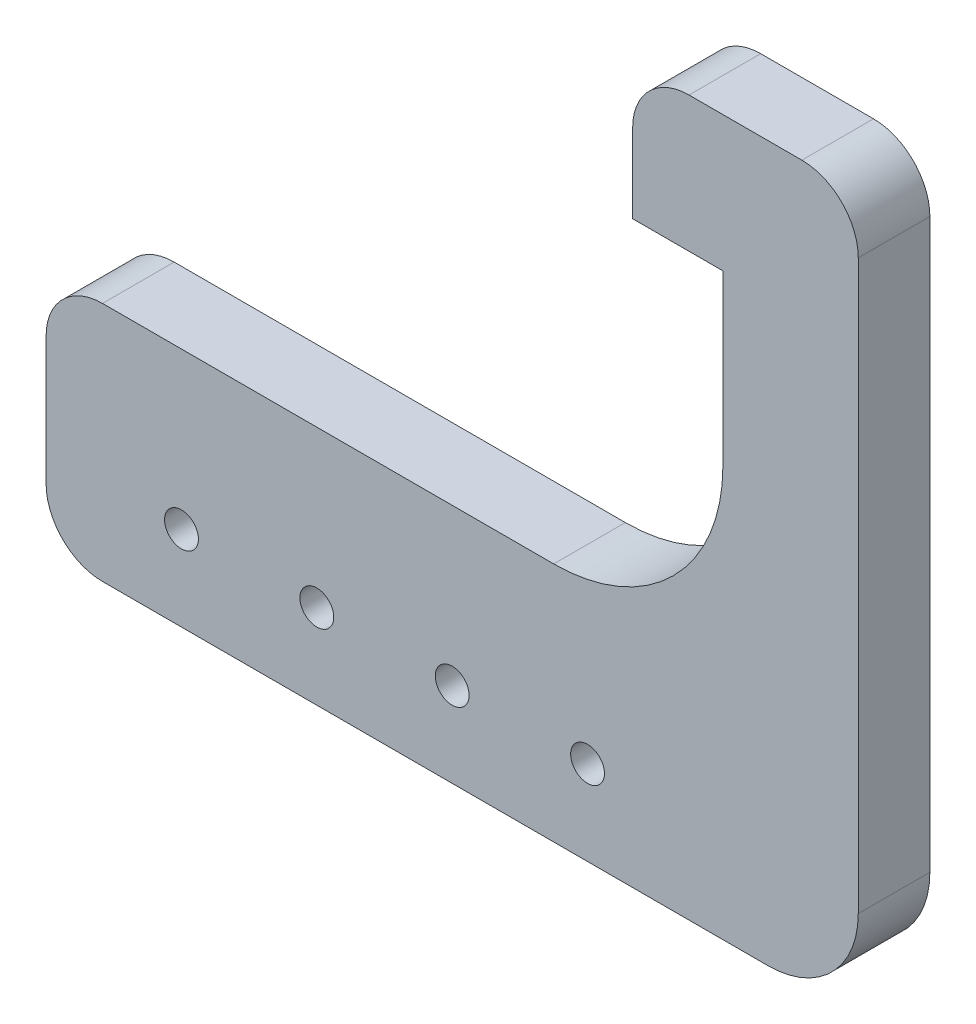
ISO-10303-21;
HEADER;
FILE_DESCRIPTION(('STEP AP214'),'2;1');
FILE_NAME('part.step','',(''),(''),'','','');
FILE_SCHEMA(('AUTOMOTIVE_DESIGN { 1 0 10303 214 1 1 1 1 }'));
ENDSEC;
DATA;
#1=APPLICATION_CONTEXT('core data for automotive mechanical design processes');
#2=APPLICATION_PROTOCOL_DEFINITION('international standard','automotive_design',2000,#1);
#3=PRODUCT_CONTEXT('',#1,'mechanical');
#4=PRODUCT('Part','Part','',(#3));
#5=PRODUCT_RELATED_PRODUCT_CATEGORY('part','',(#4));
#6=PRODUCT_DEFINITION_FORMATION('','',#4);
#7=PRODUCT_DEFINITION_CONTEXT('part definition',#1,'design');
#8=PRODUCT_DEFINITION('design','',#6,#7);
#9=PRODUCT_DEFINITION_SHAPE('','',#8);
#10=(LENGTH_UNIT() NAMED_UNIT(*) SI_UNIT(.MILLI.,.METRE.));
#11=(NAMED_UNIT(*) PLANE_ANGLE_UNIT() SI_UNIT($,.RADIAN.));
#12=(NAMED_UNIT(*) SI_UNIT($,.STERADIAN.) SOLID_ANGLE_UNIT());
#13=UNCERTAINTY_MEASURE_WITH_UNIT(LENGTH_MEASURE(1.E-05),#10,'distance_accuracy_value','');
#14=(GEOMETRIC_REPRESENTATION_CONTEXT(3) GLOBAL_UNCERTAINTY_ASSIGNED_CONTEXT((#13)) GLOBAL_UNIT_ASSIGNED_CONTEXT((#10,
#11,#12)) REPRESENTATION_CONTEXT('',''));
#15=CARTESIAN_POINT('',(0.,0.,0.));
#16=DIRECTION('',(0.,0.,1.));
#17=DIRECTION('',(1.,0.,0.));
#18=AXIS2_PLACEMENT_3D('',#15,#16,#17);
#19=CARTESIAN_POINT('',(0.,0.,6.35));
#20=DIRECTION('',(0.,1.,0.));
#21=DIRECTION('',(0.,0.,1.));
#22=AXIS2_PLACEMENT_3D('',#19,#20,#21);
#23=PLANE('',#22);
#24=DIRECTION('',(1.,0.,0.));
#25=VECTOR('',#24,1.);
#26=CARTESIAN_POINT('',(0.,0.,0.));
#27=LINE('',#26,#25);
#28=CARTESIAN_POINT('',(5.,0.,0.));
#29=VERTEX_POINT('',#28);
#30=CARTESIAN_POINT('',(64.,0.,0.));
#31=VERTEX_POINT('',#30);
#32=EDGE_CURVE('E204',#29,#31,#27,.T.);
#33=ORIENTED_EDGE('',*,*,#32,.T.);
#34=DIRECTION('',(0.,0.,-1.));
#35=VECTOR('',#34,1.);
#36=CARTESIAN_POINT('',(64.,0.,6.35));
#37=LINE('',#36,#35);
#38=CARTESIAN_POINT('',(64.,0.,6.35));
#39=VERTEX_POINT('',#38);
#40=EDGE_CURVE('E52',#31,#39,#37,.F.);
#41=ORIENTED_EDGE('',*,*,#40,.T.);
#42=DIRECTION('',(1.,0.,0.));
#43=VECTOR('',#42,1.);
#44=CARTESIAN_POINT('',(0.,0.,6.35));
#45=LINE('',#44,#43);
#46=CARTESIAN_POINT('',(5.,0.,6.35));
#47=VERTEX_POINT('',#46);
#48=EDGE_CURVE('E324',#47,#39,#45,.T.);
#49=ORIENTED_EDGE('',*,*,#48,.F.);
#50=DIRECTION('',(0.,0.,-1.));
#51=VECTOR('',#50,1.);
#52=CARTESIAN_POINT('',(5.,0.,0.));
#53=LINE('',#52,#51);
#54=EDGE_CURVE('E279',#47,#29,#53,.T.);
#55=ORIENTED_EDGE('',*,*,#54,.T.);
#56=EDGE_LOOP('',(#33,#41,#49,#55));
#57=FACE_BOUND('',#56,.T.);
#58=ADVANCED_FACE('F43',(#57),#23,.F.);
#59=CARTESIAN_POINT('',(72.,0.,6.35));
#60=DIRECTION('',(-1.,0.,0.));
#61=DIRECTION('',(0.,-1.,0.));
#62=AXIS2_PLACEMENT_3D('',#59,#60,#61);
#63=PLANE('',#62);
#64=DIRECTION('',(0.,1.,0.));
#65=VECTOR('',#64,1.);
#66=CARTESIAN_POINT('',(72.,0.,6.35));
#67=LINE('',#66,#65);
#68=CARTESIAN_POINT('',(72.,8.,6.35));
#69=VERTEX_POINT('',#68);
#70=CARTESIAN_POINT('',(72.,58.35,6.35));
#71=VERTEX_POINT('',#70);
#72=EDGE_CURVE('E308',#69,#71,#67,.T.);
#73=ORIENTED_EDGE('',*,*,#72,.F.);
#74=DIRECTION('',(0.,0.,-1.));
#75=VECTOR('',#74,1.);
#76=CARTESIAN_POINT('',(72.,8.,6.35));
#77=LINE('',#76,#75);
#78=CARTESIAN_POINT('',(72.,8.,0.));
#79=VERTEX_POINT('',#78);
#80=EDGE_CURVE('E298',#69,#79,#77,.T.);
#81=ORIENTED_EDGE('',*,*,#80,.T.);
#82=DIRECTION('',(0.,1.,0.));
#83=VECTOR('',#82,1.);
#84=CARTESIAN_POINT('',(72.,0.,0.));
#85=LINE('',#84,#83);
#86=CARTESIAN_POINT('',(72.,58.35,0.));
#87=VERTEX_POINT('',#86);
#88=EDGE_CURVE('E207',#79,#87,#85,.T.);
#89=ORIENTED_EDGE('',*,*,#88,.T.);
#90=DIRECTION('',(0.,0.,-1.));
#91=VECTOR('',#90,1.);
#92=CARTESIAN_POINT('',(72.,58.35,6.35));
#93=LINE('',#92,#91);
#94=EDGE_CURVE('E291',#87,#71,#93,.F.);
#95=ORIENTED_EDGE('',*,*,#94,.T.);
#96=EDGE_LOOP('',(#73,#81,#89,#95));
#97=FACE_BOUND('',#96,.T.);
#98=ADVANCED_FACE('F307',(#97),#63,.F.);
#99=CARTESIAN_POINT('',(0.,63.35,6.35));
#100=DIRECTION('',(0.,-1.,0.));
#101=DIRECTION('',(0.,0.,-1.));
#102=AXIS2_PLACEMENT_3D('',#99,#100,#101);
#103=PLANE('',#102);
#104=DIRECTION('',(-1.,0.,0.));
#105=VECTOR('',#104,1.);
#106=CARTESIAN_POINT('',(0.,63.35,6.35));
#107=LINE('',#106,#105);
#108=CARTESIAN_POINT('',(67.,63.35,6.35));
#109=VERTEX_POINT('',#108);
#110=CARTESIAN_POINT('',(57.,63.35,6.35));
#111=VERTEX_POINT('',#110);
#112=EDGE_CURVE('E169',#109,#111,#107,.T.);
#113=ORIENTED_EDGE('',*,*,#112,.F.);
#114=DIRECTION('',(0.,0.,-1.));
#115=VECTOR('',#114,1.);
#116=CARTESIAN_POINT('',(67.,63.35,6.35));
#117=LINE('',#116,#115);
#118=CARTESIAN_POINT('',(67.,63.35,0.));
#119=VERTEX_POINT('',#118);
#120=EDGE_CURVE('E283',#109,#119,#117,.T.);
#121=ORIENTED_EDGE('',*,*,#120,.T.);
#122=DIRECTION('',(-1.,0.,0.));
#123=VECTOR('',#122,1.);
#124=CARTESIAN_POINT('',(0.,63.35,0.));
#125=LINE('',#124,#123);
#126=CARTESIAN_POINT('',(57.,63.35,0.));
#127=VERTEX_POINT('',#126);
#128=EDGE_CURVE('E210',#119,#127,#125,.T.);
#129=ORIENTED_EDGE('',*,*,#128,.T.);
#130=DIRECTION('',(0.,0.,-1.));
#131=VECTOR('',#130,1.);
#132=CARTESIAN_POINT('',(57.,63.35,6.35));
#133=LINE('',#132,#131);
#134=EDGE_CURVE('E251',#127,#111,#133,.F.);
#135=ORIENTED_EDGE('',*,*,#134,.T.);
#136=EDGE_LOOP('',(#113,#121,#129,#135));
#137=FACE_BOUND('',#136,.T.);
#138=ADVANCED_FACE('F320',(#137),#103,.F.);
#139=CARTESIAN_POINT('',(52.,0.,6.35));
#140=DIRECTION('',(-1.,0.,0.));
#141=DIRECTION('',(0.,0.,1.));
#142=AXIS2_PLACEMENT_3D('',#139,#140,#141);
#143=PLANE('',#142);
#144=DIRECTION('',(0.,1.,0.));
#145=VECTOR('',#144,1.);
#146=CARTESIAN_POINT('',(52.,0.,6.35));
#147=LINE('',#146,#145);
#148=CARTESIAN_POINT('',(52.,51.35,6.35));
#149=VERTEX_POINT('',#148);
#150=CARTESIAN_POINT('',(52.,58.35,6.35));
#151=VERTEX_POINT('',#150);
#152=EDGE_CURVE('E149',#149,#151,#147,.T.);
#153=ORIENTED_EDGE('',*,*,#152,.T.);
#154=DIRECTION('',(0.,0.,-1.));
#155=VECTOR('',#154,1.);
#156=CARTESIAN_POINT('',(52.,58.35,0.));
#157=LINE('',#156,#155);
#158=CARTESIAN_POINT('',(52.,58.35,0.));
#159=VERTEX_POINT('',#158);
#160=EDGE_CURVE('E244',#151,#159,#157,.T.);
#161=ORIENTED_EDGE('',*,*,#160,.T.);
#162=DIRECTION('',(0.,1.,0.));
#163=VECTOR('',#162,1.);
#164=CARTESIAN_POINT('',(52.,0.,0.));
#165=LINE('',#164,#163);
#166=CARTESIAN_POINT('',(52.,51.35,0.));
#167=VERTEX_POINT('',#166);
#168=EDGE_CURVE('E152',#167,#159,#165,.T.);
#169=ORIENTED_EDGE('',*,*,#168,.F.);
#170=DIRECTION('',(0.,0.,-1.));
#171=VECTOR('',#170,1.);
#172=CARTESIAN_POINT('',(52.,51.35,6.35));
#173=LINE('',#172,#171);
#174=EDGE_CURVE('E145',#149,#167,#173,.T.);
#175=ORIENTED_EDGE('',*,*,#174,.F.);
#176=EDGE_LOOP('',(#153,#161,#169,#175));
#177=FACE_BOUND('',#176,.T.);
#178=ADVANCED_FACE('F147',(#177),#143,.T.);
#179=CARTESIAN_POINT('',(0.,51.35,6.35));
#180=DIRECTION('',(0.,-1.,0.));
#181=DIRECTION('',(0.,0.,-1.));
#182=AXIS2_PLACEMENT_3D('',#179,#180,#181);
#183=PLANE('',#182);
#184=DIRECTION('',(-1.,0.,0.));
#185=VECTOR('',#184,1.);
#186=CARTESIAN_POINT('',(0.,51.35,0.));
#187=LINE('',#186,#185);
#188=CARTESIAN_POINT('',(60.,51.35,0.));
#189=VERTEX_POINT('',#188);
#190=EDGE_CURVE('E215',#189,#167,#187,.T.);
#191=ORIENTED_EDGE('',*,*,#190,.F.);
#192=DIRECTION('',(0.,0.,-1.));
#193=VECTOR('',#192,1.);
#194=CARTESIAN_POINT('',(60.,51.35,6.35));
#195=LINE('',#194,#193);
#196=CARTESIAN_POINT('',(60.,51.35,6.35));
#197=VERTEX_POINT('',#196);
#198=EDGE_CURVE('E159',#197,#189,#195,.T.);
#199=ORIENTED_EDGE('',*,*,#198,.F.);
#200=DIRECTION('',(-1.,0.,0.));
#201=VECTOR('',#200,1.);
#202=CARTESIAN_POINT('',(0.,51.35,6.35));
#203=LINE('',#202,#201);
#204=EDGE_CURVE('E165',#197,#149,#203,.T.);
#205=ORIENTED_EDGE('',*,*,#204,.T.);
#206=ORIENTED_EDGE('',*,*,#174,.T.);
#207=EDGE_LOOP('',(#191,#199,#205,#206));
#208=FACE_BOUND('',#207,.T.);
#209=ADVANCED_FACE('F172',(#208),#183,.T.);
#210=CARTESIAN_POINT('',(60.,0.,6.35));
#211=DIRECTION('',(-1.,0.,0.));
#212=DIRECTION('',(0.,0.,1.));
#213=AXIS2_PLACEMENT_3D('',#210,#211,#212);
#214=PLANE('',#213);
#215=DIRECTION('',(0.,1.,0.));
#216=VECTOR('',#215,1.);
#217=CARTESIAN_POINT('',(60.,0.,0.));
#218=LINE('',#217,#216);
#219=CARTESIAN_POINT('',(60.,36.35,0.));
#220=VERTEX_POINT('',#219);
#221=EDGE_CURVE('E218',#220,#189,#218,.T.);
#222=ORIENTED_EDGE('',*,*,#221,.F.);
#223=DIRECTION('',(0.,0.,-1.));
#224=VECTOR('',#223,1.);
#225=CARTESIAN_POINT('',(60.,36.35,6.35));
#226=LINE('',#225,#224);
#227=CARTESIAN_POINT('',(60.,36.35,6.35));
#228=VERTEX_POINT('',#227);
#229=EDGE_CURVE('E234',#220,#228,#226,.F.);
#230=ORIENTED_EDGE('',*,*,#229,.T.);
#231=DIRECTION('',(0.,1.,0.));
#232=VECTOR('',#231,1.);
#233=CARTESIAN_POINT('',(60.,0.,6.35));
#234=LINE('',#233,#232);
#235=EDGE_CURVE('E175',#228,#197,#234,.T.);
#236=ORIENTED_EDGE('',*,*,#235,.T.);
#237=ORIENTED_EDGE('',*,*,#198,.T.);
#238=EDGE_LOOP('',(#222,#230,#236,#237));
#239=FACE_BOUND('',#238,.T.);
#240=ADVANCED_FACE('F429',(#239),#214,.T.);
#241=CARTESIAN_POINT('',(0.,21.35,6.35));
#242=DIRECTION('',(0.,1.,0.));
#243=DIRECTION('',(0.,0.,1.));
#244=AXIS2_PLACEMENT_3D('',#241,#242,#243);
#245=PLANE('',#244);
#246=DIRECTION('',(1.,0.,0.));
#247=VECTOR('',#246,1.);
#248=CARTESIAN_POINT('',(0.,21.35,0.));
#249=LINE('',#248,#247);
#250=CARTESIAN_POINT('',(5.,21.35,0.));
#251=VERTEX_POINT('',#250);
#252=CARTESIAN_POINT('',(45.,21.35,0.));
#253=VERTEX_POINT('',#252);
#254=EDGE_CURVE('E221',#251,#253,#249,.T.);
#255=ORIENTED_EDGE('',*,*,#254,.F.);
#256=DIRECTION('',(0.,0.,-1.));
#257=VECTOR('',#256,1.);
#258=CARTESIAN_POINT('',(5.,21.35,6.35));
#259=LINE('',#258,#257);
#260=CARTESIAN_POINT('',(5.,21.35,6.35));
#261=VERTEX_POINT('',#260);
#262=EDGE_CURVE('E270',#251,#261,#259,.F.);
#263=ORIENTED_EDGE('',*,*,#262,.T.);
#264=DIRECTION('',(1.,0.,0.));
#265=VECTOR('',#264,1.);
#266=CARTESIAN_POINT('',(0.,21.35,6.35));
#267=LINE('',#266,#265);
#268=CARTESIAN_POINT('',(45.,21.35,6.35));
#269=VERTEX_POINT('',#268);
#270=EDGE_CURVE('E178',#261,#269,#267,.T.);
#271=ORIENTED_EDGE('',*,*,#270,.T.);
#272=DIRECTION('',(0.,0.,-1.));
#273=VECTOR('',#272,1.);
#274=CARTESIAN_POINT('',(45.,21.35,0.));
#275=LINE('',#274,#273);
#276=EDGE_CURVE('E158',#269,#253,#275,.T.);
#277=ORIENTED_EDGE('',*,*,#276,.T.);
#278=EDGE_LOOP('',(#255,#263,#271,#277));
#279=FACE_BOUND('',#278,.T.);
#280=ADVANCED_FACE('F362',(#279),#245,.T.);
#281=CARTESIAN_POINT('',(48.,7.5,6.35));
#282=DIRECTION('',(0.,0.,-1.));
#283=DIRECTION('',(-1.,0.,0.));
#284=AXIS2_PLACEMENT_3D('',#281,#282,#283);
#285=CYLINDRICAL_SURFACE('',#284,1.5);
#286=CARTESIAN_POINT('',(48.,7.5,6.35));
#287=DIRECTION('',(0.,0.,1.));
#288=DIRECTION('',(1.,0.,0.));
#289=AXIS2_PLACEMENT_3D('',#286,#287,#288);
#290=CIRCLE('',#289,1.5);
#291=CARTESIAN_POINT('',(49.5,7.5,6.35));
#292=VERTEX_POINT('',#291);
#293=EDGE_CURVE('E329',#292,#292,#290,.T.);
#294=ORIENTED_EDGE('',*,*,#293,.T.);
#295=EDGE_LOOP('',(#294));
#296=FACE_BOUND('',#295,.T.);
#297=CARTESIAN_POINT('',(48.,7.5,0.));
#298=DIRECTION('',(0.,0.,1.));
#299=DIRECTION('',(1.,0.,0.));
#300=AXIS2_PLACEMENT_3D('',#297,#298,#299);
#301=CIRCLE('',#300,1.5);
#302=CARTESIAN_POINT('',(49.5,7.5,0.));
#303=VERTEX_POINT('',#302);
#304=EDGE_CURVE('E200',#303,#303,#301,.T.);
#305=ORIENTED_EDGE('',*,*,#304,.F.);
#306=EDGE_LOOP('',(#305));
#307=FACE_BOUND('',#306,.T.);
#308=ADVANCED_FACE('F358',(#296,#307),#285,.F.);
#309=CARTESIAN_POINT('',(36.,7.49999999999992,6.35));
#310=DIRECTION('',(0.,0.,-1.));
#311=DIRECTION('',(-1.,0.,0.));
#312=AXIS2_PLACEMENT_3D('',#309,#310,#311);
#313=CYLINDRICAL_SURFACE('',#312,1.5);
#314=CARTESIAN_POINT('',(36.,7.49999999999992,6.35));
#315=DIRECTION('',(0.,0.,1.));
#316=DIRECTION('',(1.,0.,0.));
#317=AXIS2_PLACEMENT_3D('',#314,#315,#316);
#318=CIRCLE('',#317,1.5);
#319=CARTESIAN_POINT('',(37.5,7.49999999999992,6.35));
#320=VERTEX_POINT('',#319);
#321=EDGE_CURVE('E333',#320,#320,#318,.T.);
#322=ORIENTED_EDGE('',*,*,#321,.T.);
#323=EDGE_LOOP('',(#322));
#324=FACE_BOUND('',#323,.T.);
#325=CARTESIAN_POINT('',(36.,7.49999999999992,0.));
#326=DIRECTION('',(0.,0.,1.));
#327=DIRECTION('',(1.,0.,0.));
#328=AXIS2_PLACEMENT_3D('',#325,#326,#327);
#329=CIRCLE('',#328,1.5);
#330=CARTESIAN_POINT('',(37.5,7.49999999999992,0.));
#331=VERTEX_POINT('',#330);
#332=EDGE_CURVE('E196',#331,#331,#329,.T.);
#333=ORIENTED_EDGE('',*,*,#332,.F.);
#334=EDGE_LOOP('',(#333));
#335=FACE_BOUND('',#334,.T.);
#336=ADVANCED_FACE('F361',(#324,#335),#313,.F.);
#337=CARTESIAN_POINT('',(24.,7.49999999999983,6.35));
#338=DIRECTION('',(0.,0.,-1.));
#339=DIRECTION('',(-1.,0.,0.));
#340=AXIS2_PLACEMENT_3D('',#337,#338,#339);
#341=CYLINDRICAL_SURFACE('',#340,1.5);
#342=CARTESIAN_POINT('',(24.,7.49999999999983,6.35));
#343=DIRECTION('',(0.,0.,1.));
#344=DIRECTION('',(1.,0.,0.));
#345=AXIS2_PLACEMENT_3D('',#342,#343,#344);
#346=CIRCLE('',#345,1.5);
#347=CARTESIAN_POINT('',(25.5,7.49999999999983,6.35));
#348=VERTEX_POINT('',#347);
#349=EDGE_CURVE('E337',#348,#348,#346,.T.);
#350=ORIENTED_EDGE('',*,*,#349,.T.);
#351=EDGE_LOOP('',(#350));
#352=FACE_BOUND('',#351,.T.);
#353=CARTESIAN_POINT('',(24.,7.49999999999983,0.));
#354=DIRECTION('',(0.,0.,1.));
#355=DIRECTION('',(1.,0.,0.));
#356=AXIS2_PLACEMENT_3D('',#353,#354,#355);
#357=CIRCLE('',#356,1.5);
#358=CARTESIAN_POINT('',(25.5,7.49999999999983,0.));
#359=VERTEX_POINT('',#358);
#360=EDGE_CURVE('E192',#359,#359,#357,.T.);
#361=ORIENTED_EDGE('',*,*,#360,.F.);
#362=EDGE_LOOP('',(#361));
#363=FACE_BOUND('',#362,.T.);
#364=ADVANCED_FACE('F388',(#352,#363),#341,.F.);
#365=CARTESIAN_POINT('',(12.,7.49999999999975,6.35));
#366=DIRECTION('',(0.,0.,-1.));
#367=DIRECTION('',(-1.,0.,0.));
#368=AXIS2_PLACEMENT_3D('',#365,#366,#367);
#369=CYLINDRICAL_SURFACE('',#368,1.5);
#370=CARTESIAN_POINT('',(12.,7.49999999999975,6.35));
#371=DIRECTION('',(0.,0.,1.));
#372=DIRECTION('',(1.,0.,0.));
#373=AXIS2_PLACEMENT_3D('',#370,#371,#372);
#374=CIRCLE('',#373,1.5);
#375=CARTESIAN_POINT('',(13.5,7.49999999999975,6.35));
#376=VERTEX_POINT('',#375);
#377=EDGE_CURVE('E228',#376,#376,#374,.T.);
#378=ORIENTED_EDGE('',*,*,#377,.T.);
#379=EDGE_LOOP('',(#378));
#380=FACE_BOUND('',#379,.T.);
#381=CARTESIAN_POINT('',(12.,7.49999999999975,0.));
#382=DIRECTION('',(0.,0.,1.));
#383=DIRECTION('',(1.,0.,0.));
#384=AXIS2_PLACEMENT_3D('',#381,#382,#383);
#385=CIRCLE('',#384,1.5);
#386=CARTESIAN_POINT('',(13.5,7.49999999999975,0.));
#387=VERTEX_POINT('',#386);
#388=EDGE_CURVE('E188',#387,#387,#385,.T.);
#389=ORIENTED_EDGE('',*,*,#388,.F.);
#390=EDGE_LOOP('',(#389));
#391=FACE_BOUND('',#390,.T.);
#392=ADVANCED_FACE('F345',(#380,#391),#369,.F.);
#393=CARTESIAN_POINT('',(0.,0.,6.35));
#394=DIRECTION('',(-1.,0.,0.));
#395=DIRECTION('',(0.,0.,1.));
#396=AXIS2_PLACEMENT_3D('',#393,#394,#395);
#397=PLANE('',#396);
#398=DIRECTION('',(0.,1.,0.));
#399=VECTOR('',#398,1.);
#400=CARTESIAN_POINT('',(0.,0.,6.35));
#401=LINE('',#400,#399);
#402=CARTESIAN_POINT('',(0.,5.,6.35));
#403=VERTEX_POINT('',#402);
#404=CARTESIAN_POINT('',(0.,16.35,6.35));
#405=VERTEX_POINT('',#404);
#406=EDGE_CURVE('E184',#403,#405,#401,.T.);
#407=ORIENTED_EDGE('',*,*,#406,.T.);
#408=DIRECTION('',(0.,0.,-1.));
#409=VECTOR('',#408,1.);
#410=CARTESIAN_POINT('',(0.,16.35,6.35));
#411=LINE('',#410,#409);
#412=CARTESIAN_POINT('',(0.,16.35,0.));
#413=VERTEX_POINT('',#412);
#414=EDGE_CURVE('E260',#405,#413,#411,.T.);
#415=ORIENTED_EDGE('',*,*,#414,.T.);
#416=DIRECTION('',(0.,1.,0.));
#417=VECTOR('',#416,1.);
#418=CARTESIAN_POINT('',(0.,0.,0.));
#419=LINE('',#418,#417);
#420=CARTESIAN_POINT('',(0.,5.,0.));
#421=VERTEX_POINT('',#420);
#422=EDGE_CURVE('E224',#421,#413,#419,.T.);
#423=ORIENTED_EDGE('',*,*,#422,.F.);
#424=DIRECTION('',(0.,0.,-1.));
#425=VECTOR('',#424,1.);
#426=CARTESIAN_POINT('',(0.,5.,6.35));
#427=LINE('',#426,#425);
#428=EDGE_CURVE('E257',#421,#403,#427,.F.);
#429=ORIENTED_EDGE('',*,*,#428,.T.);
#430=EDGE_LOOP('',(#407,#415,#423,#429));
#431=FACE_BOUND('',#430,.T.);
#432=ADVANCED_FACE('F350',(#431),#397,.T.);
#433=CARTESIAN_POINT('',(0.,0.,6.35));
#434=DIRECTION('',(0.,0.,1.));
#435=DIRECTION('',(1.,0.,0.));
#436=AXIS2_PLACEMENT_3D('',#433,#434,#435);
#437=PLANE('',#436);
#438=ORIENTED_EDGE('',*,*,#377,.F.);
#439=EDGE_LOOP('',(#438));
#440=FACE_BOUND('',#439,.T.);
#441=ORIENTED_EDGE('',*,*,#349,.F.);
#442=EDGE_LOOP('',(#441));
#443=FACE_BOUND('',#442,.T.);
#444=ORIENTED_EDGE('',*,*,#321,.F.);
#445=EDGE_LOOP('',(#444));
#446=FACE_BOUND('',#445,.T.);
#447=ORIENTED_EDGE('',*,*,#293,.F.);
#448=EDGE_LOOP('',(#447));
#449=FACE_BOUND('',#448,.T.);
#450=ORIENTED_EDGE('',*,*,#48,.T.);
#451=CARTESIAN_POINT('',(64.,8.,6.35));
#452=DIRECTION('',(0.,0.,1.));
#453=DIRECTION('',(1.,0.,0.));
#454=AXIS2_PLACEMENT_3D('',#451,#452,#453);
#455=CIRCLE('',#454,8.);
#456=EDGE_CURVE('E11',#39,#69,#455,.T.);
#457=ORIENTED_EDGE('',*,*,#456,.T.);
#458=ORIENTED_EDGE('',*,*,#72,.T.);
#459=CARTESIAN_POINT('',(67.,58.35,6.35));
#460=DIRECTION('',(0.,0.,1.));
#461=DIRECTION('',(1.,0.,0.));
#462=AXIS2_PLACEMENT_3D('',#459,#460,#461);
#463=CIRCLE('',#462,5.);
#464=EDGE_CURVE('E295',#71,#109,#463,.T.);
#465=ORIENTED_EDGE('',*,*,#464,.T.);
#466=ORIENTED_EDGE('',*,*,#112,.T.);
#467=CARTESIAN_POINT('',(57.,58.35,6.35));
#468=DIRECTION('',(0.,0.,1.));
#469=DIRECTION('',(1.,0.,0.));
#470=AXIS2_PLACEMENT_3D('',#467,#468,#469);
#471=CIRCLE('',#470,5.);
#472=EDGE_CURVE('E167',#111,#151,#471,.T.);
#473=ORIENTED_EDGE('',*,*,#472,.T.);
#474=ORIENTED_EDGE('',*,*,#152,.F.);
#475=ORIENTED_EDGE('',*,*,#204,.F.);
#476=ORIENTED_EDGE('',*,*,#235,.F.);
#477=CARTESIAN_POINT('',(45.,36.35,6.35));
#478=DIRECTION('',(0.,0.,1.));
#479=DIRECTION('',(1.,0.,0.));
#480=AXIS2_PLACEMENT_3D('',#477,#478,#479);
#481=CIRCLE('',#480,15.);
#482=EDGE_CURVE('E240',#228,#269,#481,.F.);
#483=ORIENTED_EDGE('',*,*,#482,.T.);
#484=ORIENTED_EDGE('',*,*,#270,.F.);
#485=CARTESIAN_POINT('',(5.,16.35,6.35));
#486=DIRECTION('',(0.,0.,1.));
#487=DIRECTION('',(1.,0.,0.));
#488=AXIS2_PLACEMENT_3D('',#485,#486,#487);
#489=CIRCLE('',#488,5.);
#490=EDGE_CURVE('E276',#261,#405,#489,.T.);
#491=ORIENTED_EDGE('',*,*,#490,.T.);
#492=ORIENTED_EDGE('',*,*,#406,.F.);
#493=CARTESIAN_POINT('',(5.,5.,6.35));
#494=DIRECTION('',(0.,0.,1.));
#495=DIRECTION('',(1.,0.,0.));
#496=AXIS2_PLACEMENT_3D('',#493,#494,#495);
#497=CIRCLE('',#496,5.);
#498=EDGE_CURVE('E273',#403,#47,#497,.T.);
#499=ORIENTED_EDGE('',*,*,#498,.T.);
#500=EDGE_LOOP('',(#450,#457,#458,#465,#466,#473,#474,#475,#476,#483,#484,#491,#492,#499));
#501=FACE_BOUND('',#500,.T.);
#502=ADVANCED_FACE('F163',(#440,#443,#446,#449,#501),#437,.T.);
#503=CARTESIAN_POINT('',(0.,0.,0.));
#504=DIRECTION('',(0.,0.,1.));
#505=DIRECTION('',(1.,0.,0.));
#506=AXIS2_PLACEMENT_3D('',#503,#504,#505);
#507=PLANE('',#506);
#508=ORIENTED_EDGE('',*,*,#388,.T.);
#509=EDGE_LOOP('',(#508));
#510=FACE_BOUND('',#509,.T.);
#511=ORIENTED_EDGE('',*,*,#360,.T.);
#512=EDGE_LOOP('',(#511));
#513=FACE_BOUND('',#512,.T.);
#514=ORIENTED_EDGE('',*,*,#332,.T.);
#515=EDGE_LOOP('',(#514));
#516=FACE_BOUND('',#515,.T.);
#517=ORIENTED_EDGE('',*,*,#304,.T.);
#518=EDGE_LOOP('',(#517));
#519=FACE_BOUND('',#518,.T.);
#520=ORIENTED_EDGE('',*,*,#88,.F.);
#521=CARTESIAN_POINT('',(64.,8.,0.));
#522=DIRECTION('',(0.,0.,1.));
#523=DIRECTION('',(1.,0.,0.));
#524=AXIS2_PLACEMENT_3D('',#521,#522,#523);
#525=CIRCLE('',#524,8.);
#526=EDGE_CURVE('E66',#79,#31,#525,.F.);
#527=ORIENTED_EDGE('',*,*,#526,.T.);
#528=ORIENTED_EDGE('',*,*,#32,.F.);
#529=CARTESIAN_POINT('',(5.,5.,0.));
#530=DIRECTION('',(0.,0.,1.));
#531=DIRECTION('',(1.,0.,0.));
#532=AXIS2_PLACEMENT_3D('',#529,#530,#531);
#533=CIRCLE('',#532,5.);
#534=EDGE_CURVE('E264',#29,#421,#533,.F.);
#535=ORIENTED_EDGE('',*,*,#534,.T.);
#536=ORIENTED_EDGE('',*,*,#422,.T.);
#537=CARTESIAN_POINT('',(5.,16.35,0.));
#538=DIRECTION('',(0.,0.,1.));
#539=DIRECTION('',(1.,0.,0.));
#540=AXIS2_PLACEMENT_3D('',#537,#538,#539);
#541=CIRCLE('',#540,5.);
#542=EDGE_CURVE('E267',#413,#251,#541,.F.);
#543=ORIENTED_EDGE('',*,*,#542,.T.);
#544=ORIENTED_EDGE('',*,*,#254,.T.);
#545=CARTESIAN_POINT('',(45.,36.35,0.));
#546=DIRECTION('',(0.,0.,1.));
#547=DIRECTION('',(1.,0.,0.));
#548=AXIS2_PLACEMENT_3D('',#545,#546,#547);
#549=CIRCLE('',#548,15.);
#550=EDGE_CURVE('E237',#253,#220,#549,.T.);
#551=ORIENTED_EDGE('',*,*,#550,.T.);
#552=ORIENTED_EDGE('',*,*,#221,.T.);
#553=ORIENTED_EDGE('',*,*,#190,.T.);
#554=ORIENTED_EDGE('',*,*,#168,.T.);
#555=CARTESIAN_POINT('',(57.,58.35,0.));
#556=DIRECTION('',(0.,0.,1.));
#557=DIRECTION('',(1.,0.,0.));
#558=AXIS2_PLACEMENT_3D('',#555,#556,#557);
#559=CIRCLE('',#558,5.);
#560=EDGE_CURVE('E247',#159,#127,#559,.F.);
#561=ORIENTED_EDGE('',*,*,#560,.T.);
#562=ORIENTED_EDGE('',*,*,#128,.F.);
#563=CARTESIAN_POINT('',(67.,58.35,0.));
#564=DIRECTION('',(0.,0.,1.));
#565=DIRECTION('',(1.,0.,0.));
#566=AXIS2_PLACEMENT_3D('',#563,#564,#565);
#567=CIRCLE('',#566,5.);
#568=EDGE_CURVE('E287',#119,#87,#567,.F.);
#569=ORIENTED_EDGE('',*,*,#568,.T.);
#570=EDGE_LOOP('',(#520,#527,#528,#535,#536,#543,#544,#551,#552,#553,#554,#561,#562,#569));
#571=FACE_BOUND('',#570,.T.);
#572=ADVANCED_FACE('F311',(#510,#513,#516,#519,#571),#507,.F.);
#573=CARTESIAN_POINT('',(45.,36.35,6.35));
#574=DIRECTION('',(0.,0.,1.));
#575=DIRECTION('',(1.,0.,0.));
#576=AXIS2_PLACEMENT_3D('',#573,#574,#575);
#577=CYLINDRICAL_SURFACE('',#576,15.);
#578=ORIENTED_EDGE('',*,*,#482,.F.);
#579=ORIENTED_EDGE('',*,*,#229,.F.);
#580=ORIENTED_EDGE('',*,*,#550,.F.);
#581=ORIENTED_EDGE('',*,*,#276,.F.);
#582=EDGE_LOOP('',(#578,#579,#580,#581));
#583=FACE_BOUND('',#582,.T.);
#584=ADVANCED_FACE('F367',(#583),#577,.F.);
#585=CARTESIAN_POINT('',(57.,58.35,6.35));
#586=DIRECTION('',(0.,0.,1.));
#587=DIRECTION('',(1.,0.,0.));
#588=AXIS2_PLACEMENT_3D('',#585,#586,#587);
#589=CYLINDRICAL_SURFACE('',#588,5.);
#590=ORIENTED_EDGE('',*,*,#472,.F.);
#591=ORIENTED_EDGE('',*,*,#134,.F.);
#592=ORIENTED_EDGE('',*,*,#560,.F.);
#593=ORIENTED_EDGE('',*,*,#160,.F.);
#594=EDGE_LOOP('',(#590,#591,#592,#593));
#595=FACE_BOUND('',#594,.T.);
#596=ADVANCED_FACE('F373',(#595),#589,.T.);
#597=CARTESIAN_POINT('',(5.,16.35,6.35));
#598=DIRECTION('',(0.,0.,-1.));
#599=DIRECTION('',(-1.,0.,0.));
#600=AXIS2_PLACEMENT_3D('',#597,#598,#599);
#601=CYLINDRICAL_SURFACE('',#600,5.);
#602=ORIENTED_EDGE('',*,*,#490,.F.);
#603=ORIENTED_EDGE('',*,*,#262,.F.);
#604=ORIENTED_EDGE('',*,*,#542,.F.);
#605=ORIENTED_EDGE('',*,*,#414,.F.);
#606=EDGE_LOOP('',(#602,#603,#604,#605));
#607=FACE_BOUND('',#606,.T.);
#608=ADVANCED_FACE('F397',(#607),#601,.T.);
#609=CARTESIAN_POINT('',(5.,5.,6.35));
#610=DIRECTION('',(0.,0.,1.));
#611=DIRECTION('',(1.,0.,0.));
#612=AXIS2_PLACEMENT_3D('',#609,#610,#611);
#613=CYLINDRICAL_SURFACE('',#612,5.);
#614=ORIENTED_EDGE('',*,*,#498,.F.);
#615=ORIENTED_EDGE('',*,*,#428,.F.);
#616=ORIENTED_EDGE('',*,*,#534,.F.);
#617=ORIENTED_EDGE('',*,*,#54,.F.);
#618=EDGE_LOOP('',(#614,#615,#616,#617));
#619=FACE_BOUND('',#618,.T.);
#620=ADVANCED_FACE('F401',(#619),#613,.T.);
#621=CARTESIAN_POINT('',(67.,58.35,6.35));
#622=DIRECTION('',(0.,0.,-1.));
#623=DIRECTION('',(-1.,0.,0.));
#624=AXIS2_PLACEMENT_3D('',#621,#622,#623);
#625=CYLINDRICAL_SURFACE('',#624,5.);
#626=ORIENTED_EDGE('',*,*,#464,.F.);
#627=ORIENTED_EDGE('',*,*,#94,.F.);
#628=ORIENTED_EDGE('',*,*,#568,.F.);
#629=ORIENTED_EDGE('',*,*,#120,.F.);
#630=EDGE_LOOP('',(#626,#627,#628,#629));
#631=FACE_BOUND('',#630,.T.);
#632=ADVANCED_FACE('F317',(#631),#625,.T.);
#633=CARTESIAN_POINT('',(64.,8.,6.35));
#634=DIRECTION('',(0.,0.,-1.));
#635=DIRECTION('',(-1.,0.,0.));
#636=AXIS2_PLACEMENT_3D('',#633,#634,#635);
#637=CYLINDRICAL_SURFACE('',#636,8.);
#638=ORIENTED_EDGE('',*,*,#456,.F.);
#639=ORIENTED_EDGE('',*,*,#40,.F.);
#640=ORIENTED_EDGE('',*,*,#526,.F.);
#641=ORIENTED_EDGE('',*,*,#80,.F.);
#642=EDGE_LOOP('',(#638,#639,#640,#641));
#643=FACE_BOUND('',#642,.T.);
#644=ADVANCED_FACE('F45',(#643),#637,.T.);
#645=CLOSED_SHELL('',(#58,#98,#138,#178,#209,#240,#280,#308,#336,#364,#392,#432,#502,#572,#584,
#596,#608,#620,#632,#644));
#646=MANIFOLD_SOLID_BREP('B2',#645);
#647=ADVANCED_BREP_SHAPE_REPRESENTATION('',(#18,#646),#14);
#648=SHAPE_DEFINITION_REPRESENTATION(#9,#647);
ENDSEC;
END-ISO-10303-21;
